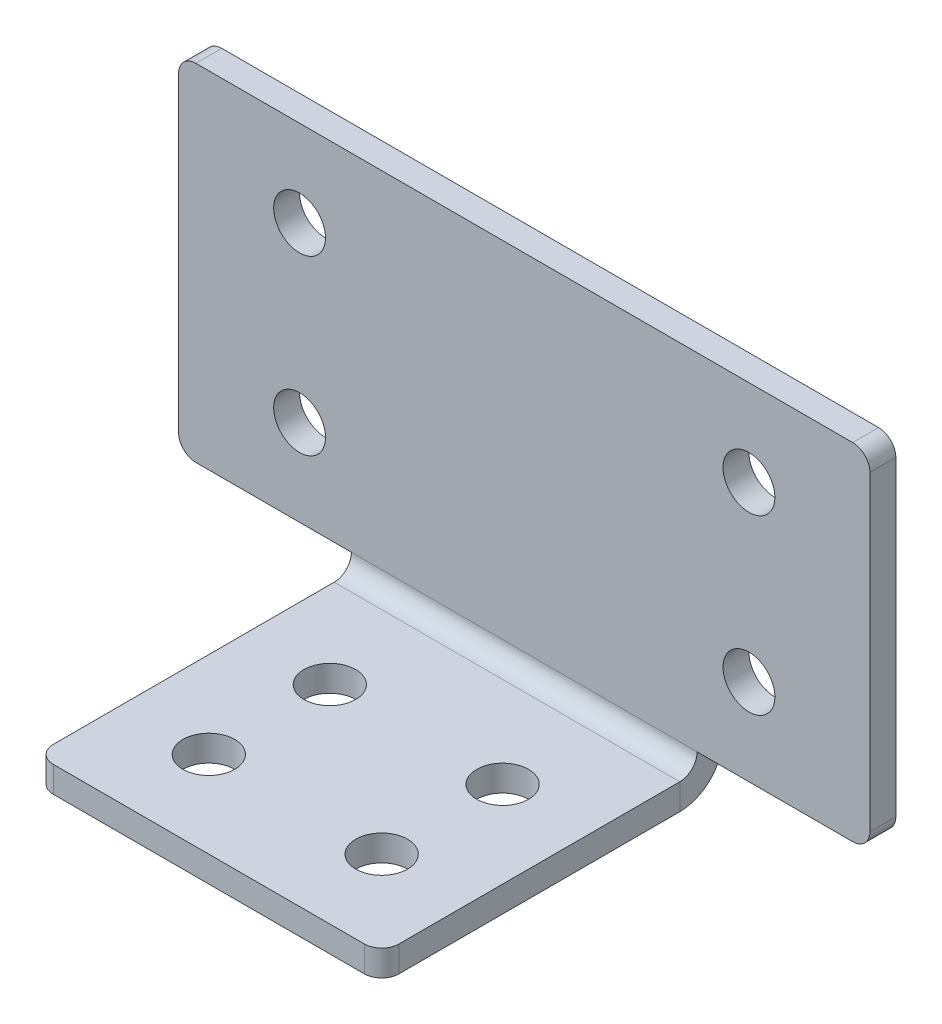
ISO-10303-21;
HEADER;
FILE_DESCRIPTION(('STEP AP214'),'2;1');
FILE_NAME('part.step','',(''),(''),'','','');
FILE_SCHEMA(('AUTOMOTIVE_DESIGN { 1 0 10303 214 1 1 1 1 }'));
ENDSEC;
DATA;
#1=APPLICATION_CONTEXT('core data for automotive mechanical design processes');
#2=APPLICATION_PROTOCOL_DEFINITION('international standard','automotive_design',2000,#1);
#3=PRODUCT_CONTEXT('',#1,'mechanical');
#4=PRODUCT('Part','Part','',(#3));
#5=PRODUCT_RELATED_PRODUCT_CATEGORY('part','',(#4));
#6=PRODUCT_DEFINITION_FORMATION('','',#4);
#7=PRODUCT_DEFINITION_CONTEXT('part definition',#1,'design');
#8=PRODUCT_DEFINITION('design','',#6,#7);
#9=PRODUCT_DEFINITION_SHAPE('','',#8);
#10=(LENGTH_UNIT() NAMED_UNIT(*) SI_UNIT(.MILLI.,.METRE.));
#11=(NAMED_UNIT(*) PLANE_ANGLE_UNIT() SI_UNIT($,.RADIAN.));
#12=(NAMED_UNIT(*) SI_UNIT($,.STERADIAN.) SOLID_ANGLE_UNIT());
#13=UNCERTAINTY_MEASURE_WITH_UNIT(LENGTH_MEASURE(1.E-05),#10,'distance_accuracy_value','');
#14=(GEOMETRIC_REPRESENTATION_CONTEXT(3) GLOBAL_UNCERTAINTY_ASSIGNED_CONTEXT((#13)) GLOBAL_UNIT_ASSIGNED_CONTEXT((#10,
#11,#12)) REPRESENTATION_CONTEXT('',''));
#15=CARTESIAN_POINT('',(0.,0.,0.));
#16=DIRECTION('',(0.,0.,1.));
#17=DIRECTION('',(1.,0.,0.));
#18=AXIS2_PLACEMENT_3D('',#15,#16,#17);
#19=CARTESIAN_POINT('',(-10.,7.50000000000007,18.2511064281089));
#20=DIRECTION('',(-1.,0.,0.));
#21=DIRECTION('',(0.,1.,0.));
#22=AXIS2_PLACEMENT_3D('',#19,#20,#21);
#23=PLANE('',#22);
#24=DIRECTION('',(0.,0.,1.));
#25=VECTOR('',#24,1.);
#26=CARTESIAN_POINT('',(-10.,7.50000000000007,18.2511064281089));
#27=LINE('',#26,#25);
#28=CARTESIAN_POINT('',(-10.,7.50000000000001,0.999999999999997));
#29=VERTEX_POINT('',#28);
#30=CARTESIAN_POINT('',(-10.,7.50000000000006,17.2511064281089));
#31=VERTEX_POINT('',#30);
#32=EDGE_CURVE('E184',#29,#31,#27,.T.);
#33=ORIENTED_EDGE('',*,*,#32,.T.);
#34=DIRECTION('',(0.,1.,0.));
#35=VECTOR('',#34,1.);
#36=CARTESIAN_POINT('',(-10.,7.50000000000006,17.2511064281089));
#37=LINE('',#36,#35);
#38=CARTESIAN_POINT('',(-10.,9.00000000000006,17.2511064281089));
#39=VERTEX_POINT('',#38);
#40=EDGE_CURVE('E247',#31,#39,#37,.T.);
#41=ORIENTED_EDGE('',*,*,#40,.T.);
#42=DIRECTION('',(0.,0.,1.));
#43=VECTOR('',#42,1.);
#44=CARTESIAN_POINT('',(-10.,9.00000000000007,18.2511064281089));
#45=LINE('',#44,#43);
#46=CARTESIAN_POINT('',(-10.,9.00000000000001,0.999999999999999));
#47=VERTEX_POINT('',#46);
#48=EDGE_CURVE('E194',#47,#39,#45,.T.);
#49=ORIENTED_EDGE('',*,*,#48,.F.);
#50=DIRECTION('',(0.,-1.,0.));
#51=VECTOR('',#50,1.);
#52=CARTESIAN_POINT('',(-10.,7.50000000000013,1.00000000000001));
#53=LINE('',#52,#51);
#54=EDGE_CURVE('E170',#47,#29,#53,.T.);
#55=ORIENTED_EDGE('',*,*,#54,.T.);
#56=EDGE_LOOP('',(#33,#41,#49,#55));
#57=FACE_BOUND('',#56,.T.);
#58=ADVANCED_FACE('F45',(#57),#23,.T.);
#59=CARTESIAN_POINT('',(10.,7.50000000000007,18.2511064281089));
#60=DIRECTION('',(1.,0.,0.));
#61=DIRECTION('',(0.,-1.,0.));
#62=AXIS2_PLACEMENT_3D('',#59,#60,#61);
#63=PLANE('',#62);
#64=DIRECTION('',(0.,0.,-1.));
#65=VECTOR('',#64,1.);
#66=CARTESIAN_POINT('',(10.,9.00000000000007,18.2511064281089));
#67=LINE('',#66,#65);
#68=CARTESIAN_POINT('',(10.,9.00000000000006,17.2511064281089));
#69=VERTEX_POINT('',#68);
#70=CARTESIAN_POINT('',(10.,9.00000000000001,0.999999999999999));
#71=VERTEX_POINT('',#70);
#72=EDGE_CURVE('E208',#69,#71,#67,.T.);
#73=ORIENTED_EDGE('',*,*,#72,.F.);
#74=DIRECTION('',(0.,1.,0.));
#75=VECTOR('',#74,1.);
#76=CARTESIAN_POINT('',(10.,7.50000000000006,17.2511064281089));
#77=LINE('',#76,#75);
#78=CARTESIAN_POINT('',(10.,7.50000000000006,17.2511064281089));
#79=VERTEX_POINT('',#78);
#80=EDGE_CURVE('E12',#69,#79,#77,.F.);
#81=ORIENTED_EDGE('',*,*,#80,.T.);
#82=DIRECTION('',(0.,0.,-1.));
#83=VECTOR('',#82,1.);
#84=CARTESIAN_POINT('',(10.,7.50000000000007,18.2511064281089));
#85=LINE('',#84,#83);
#86=CARTESIAN_POINT('',(10.,7.50000000000001,1.00000000000001));
#87=VERTEX_POINT('',#86);
#88=EDGE_CURVE('E190',#79,#87,#85,.T.);
#89=ORIENTED_EDGE('',*,*,#88,.T.);
#90=DIRECTION('',(0.,1.,0.));
#91=VECTOR('',#90,1.);
#92=CARTESIAN_POINT('',(10.,7.50000000000013,1.00000000000001));
#93=LINE('',#92,#91);
#94=EDGE_CURVE('E199',#87,#71,#93,.T.);
#95=ORIENTED_EDGE('',*,*,#94,.T.);
#96=EDGE_LOOP('',(#73,#81,#89,#95));
#97=FACE_BOUND('',#96,.T.);
#98=ADVANCED_FACE('F360',(#97),#63,.T.);
#99=CARTESIAN_POINT('',(0.,7.50000000000003,8.25110642810894));
#100=DIRECTION('',(0.,-1.,0.));
#101=DIRECTION('',(-1.,0.,0.));
#102=AXIS2_PLACEMENT_3D('',#99,#100,#101);
#103=PLANE('',#102);
#104=CARTESIAN_POINT('',(5.,7.50000000000005,13.2511064281089));
#105=DIRECTION('',(0.,-1.,0.));
#106=DIRECTION('',(0.,0.,-1.));
#107=AXIS2_PLACEMENT_3D('',#104,#105,#106);
#108=CIRCLE('',#107,1.5);
#109=CARTESIAN_POINT('',(5.,7.50000000000004,11.7511064281089));
#110=VERTEX_POINT('',#109);
#111=EDGE_CURVE('E457',#110,#110,#108,.T.);
#112=ORIENTED_EDGE('',*,*,#111,.F.);
#113=EDGE_LOOP('',(#112));
#114=FACE_BOUND('',#113,.T.);
#115=CARTESIAN_POINT('',(-5.,7.50000000000002,6.25110642810894));
#116=DIRECTION('',(0.,-1.,0.));
#117=DIRECTION('',(0.,0.,-1.));
#118=AXIS2_PLACEMENT_3D('',#115,#116,#117);
#119=CIRCLE('',#118,1.5);
#120=CARTESIAN_POINT('',(-5.,7.50000000000002,4.75110642810894));
#121=VERTEX_POINT('',#120);
#122=EDGE_CURVE('E461',#121,#121,#119,.T.);
#123=ORIENTED_EDGE('',*,*,#122,.F.);
#124=EDGE_LOOP('',(#123));
#125=FACE_BOUND('',#124,.T.);
#126=CARTESIAN_POINT('',(5.,7.50000000000002,6.25110642810894));
#127=DIRECTION('',(0.,-1.,0.));
#128=DIRECTION('',(0.,0.,-1.));
#129=AXIS2_PLACEMENT_3D('',#126,#127,#128);
#130=CIRCLE('',#129,1.5);
#131=CARTESIAN_POINT('',(5.,7.50000000000002,4.75110642810894));
#132=VERTEX_POINT('',#131);
#133=EDGE_CURVE('E465',#132,#132,#130,.T.);
#134=ORIENTED_EDGE('',*,*,#133,.F.);
#135=EDGE_LOOP('',(#134));
#136=FACE_BOUND('',#135,.T.);
#137=CARTESIAN_POINT('',(-5.,7.50000000000005,13.2511064281089));
#138=DIRECTION('',(0.,-1.,0.));
#139=DIRECTION('',(0.,0.,-1.));
#140=AXIS2_PLACEMENT_3D('',#137,#138,#139);
#141=CIRCLE('',#140,1.5);
#142=CARTESIAN_POINT('',(-5.,7.50000000000004,11.7511064281089));
#143=VERTEX_POINT('',#142);
#144=EDGE_CURVE('E278',#143,#143,#141,.T.);
#145=ORIENTED_EDGE('',*,*,#144,.F.);
#146=EDGE_LOOP('',(#145));
#147=FACE_BOUND('',#146,.T.);
#148=DIRECTION('',(1.,0.,0.));
#149=VECTOR('',#148,1.);
#150=CARTESIAN_POINT('',(-10.,7.50000000000007,18.2511064281089));
#151=LINE('',#150,#149);
#152=CARTESIAN_POINT('',(-9.,7.50000000000007,18.2511064281089));
#153=VERTEX_POINT('',#152);
#154=CARTESIAN_POINT('',(9.,7.50000000000007,18.2511064281089));
#155=VERTEX_POINT('',#154);
#156=EDGE_CURVE('E171',#153,#155,#151,.T.);
#157=ORIENTED_EDGE('',*,*,#156,.F.);
#158=CARTESIAN_POINT('',(-9.,7.50000000000006,17.2511064281089));
#159=DIRECTION('',(0.,-1.,0.));
#160=DIRECTION('',(0.,0.,-1.));
#161=AXIS2_PLACEMENT_3D('',#158,#159,#160);
#162=CIRCLE('',#161,1.);
#163=EDGE_CURVE('E54',#153,#31,#162,.T.);
#164=ORIENTED_EDGE('',*,*,#163,.T.);
#165=ORIENTED_EDGE('',*,*,#32,.F.);
#166=DIRECTION('',(1.,0.,0.));
#167=VECTOR('',#166,1.);
#168=CARTESIAN_POINT('',(0.,7.50000000000001,1.00000000000001));
#169=LINE('',#168,#167);
#170=EDGE_CURVE('E161',#29,#87,#169,.T.);
#171=ORIENTED_EDGE('',*,*,#170,.T.);
#172=ORIENTED_EDGE('',*,*,#88,.F.);
#173=CARTESIAN_POINT('',(9.,7.50000000000006,17.2511064281089));
#174=DIRECTION('',(0.,-1.,0.));
#175=DIRECTION('',(0.,0.,-1.));
#176=AXIS2_PLACEMENT_3D('',#173,#174,#175);
#177=CIRCLE('',#176,1.);
#178=EDGE_CURVE('E67',#79,#155,#177,.T.);
#179=ORIENTED_EDGE('',*,*,#178,.T.);
#180=EDGE_LOOP('',(#157,#164,#165,#171,#172,#179));
#181=FACE_BOUND('',#180,.T.);
#182=ADVANCED_FACE('F185',(#114,#125,#136,#147,#181),#103,.T.);
#183=CARTESIAN_POINT('',(-10.,7.50000000000007,18.2511064281089));
#184=DIRECTION('',(0.,0.,1.));
#185=DIRECTION('',(0.,-1.,0.));
#186=AXIS2_PLACEMENT_3D('',#183,#184,#185);
#187=PLANE('',#186);
#188=DIRECTION('',(1.,0.,0.));
#189=VECTOR('',#188,1.);
#190=CARTESIAN_POINT('',(-10.,9.00000000000007,18.2511064281089));
#191=LINE('',#190,#189);
#192=CARTESIAN_POINT('',(-9.,9.00000000000007,18.2511064281089));
#193=VERTEX_POINT('',#192);
#194=CARTESIAN_POINT('',(9.,9.00000000000007,18.2511064281089));
#195=VERTEX_POINT('',#194);
#196=EDGE_CURVE('E207',#193,#195,#191,.T.);
#197=ORIENTED_EDGE('',*,*,#196,.F.);
#198=DIRECTION('',(0.,1.,0.));
#199=VECTOR('',#198,1.);
#200=CARTESIAN_POINT('',(-9.,7.50000000000007,18.2511064281089));
#201=LINE('',#200,#199);
#202=EDGE_CURVE('E256',#193,#153,#201,.F.);
#203=ORIENTED_EDGE('',*,*,#202,.T.);
#204=ORIENTED_EDGE('',*,*,#156,.T.);
#205=DIRECTION('',(0.,1.,0.));
#206=VECTOR('',#205,1.);
#207=CARTESIAN_POINT('',(9.,7.50000000000007,18.2511064281089));
#208=LINE('',#207,#206);
#209=EDGE_CURVE('E253',#155,#195,#208,.T.);
#210=ORIENTED_EDGE('',*,*,#209,.T.);
#211=EDGE_LOOP('',(#197,#203,#204,#210));
#212=FACE_BOUND('',#211,.T.);
#213=ADVANCED_FACE('F348',(#212),#187,.T.);
#214=CARTESIAN_POINT('',(0.,9.00000000000003,8.25110642810894));
#215=DIRECTION('',(0.,-1.,0.));
#216=DIRECTION('',(-1.,0.,0.));
#217=AXIS2_PLACEMENT_3D('',#214,#215,#216);
#218=PLANE('',#217);
#219=CARTESIAN_POINT('',(5.,9.00000000000005,13.2511064281089));
#220=DIRECTION('',(0.,-1.,0.));
#221=DIRECTION('',(0.,0.,-1.));
#222=AXIS2_PLACEMENT_3D('',#219,#220,#221);
#223=CIRCLE('',#222,1.5);
#224=CARTESIAN_POINT('',(5.,9.00000000000004,11.7511064281089));
#225=VERTEX_POINT('',#224);
#226=EDGE_CURVE('E49',#225,#225,#223,.T.);
#227=ORIENTED_EDGE('',*,*,#226,.T.);
#228=EDGE_LOOP('',(#227));
#229=FACE_BOUND('',#228,.T.);
#230=CARTESIAN_POINT('',(-5.,9.00000000000002,6.25110642810894));
#231=DIRECTION('',(0.,-1.,0.));
#232=DIRECTION('',(0.,0.,-1.));
#233=AXIS2_PLACEMENT_3D('',#230,#231,#232);
#234=CIRCLE('',#233,1.5);
#235=CARTESIAN_POINT('',(-5.,9.00000000000002,4.75110642810894));
#236=VERTEX_POINT('',#235);
#237=EDGE_CURVE('E280',#236,#236,#234,.T.);
#238=ORIENTED_EDGE('',*,*,#237,.T.);
#239=EDGE_LOOP('',(#238));
#240=FACE_BOUND('',#239,.T.);
#241=CARTESIAN_POINT('',(5.,9.00000000000002,6.25110642810894));
#242=DIRECTION('',(0.,-1.,0.));
#243=DIRECTION('',(0.,0.,-1.));
#244=AXIS2_PLACEMENT_3D('',#241,#242,#243);
#245=CIRCLE('',#244,1.5);
#246=CARTESIAN_POINT('',(5.,9.00000000000002,4.75110642810894));
#247=VERTEX_POINT('',#246);
#248=EDGE_CURVE('E277',#247,#247,#245,.T.);
#249=ORIENTED_EDGE('',*,*,#248,.T.);
#250=EDGE_LOOP('',(#249));
#251=FACE_BOUND('',#250,.T.);
#252=CARTESIAN_POINT('',(-5.,9.00000000000005,13.2511064281089));
#253=DIRECTION('',(0.,-1.,0.));
#254=DIRECTION('',(0.,0.,-1.));
#255=AXIS2_PLACEMENT_3D('',#252,#253,#254);
#256=CIRCLE('',#255,1.5);
#257=CARTESIAN_POINT('',(-5.,9.00000000000004,11.7511064281089));
#258=VERTEX_POINT('',#257);
#259=EDGE_CURVE('E274',#258,#258,#256,.T.);
#260=ORIENTED_EDGE('',*,*,#259,.T.);
#261=EDGE_LOOP('',(#260));
#262=FACE_BOUND('',#261,.T.);
#263=ORIENTED_EDGE('',*,*,#48,.T.);
#264=CARTESIAN_POINT('',(-9.,9.00000000000006,17.2511064281089));
#265=DIRECTION('',(0.,-1.,0.));
#266=DIRECTION('',(0.,0.,-1.));
#267=AXIS2_PLACEMENT_3D('',#264,#265,#266);
#268=CIRCLE('',#267,1.);
#269=EDGE_CURVE('E251',#39,#193,#268,.F.);
#270=ORIENTED_EDGE('',*,*,#269,.T.);
#271=ORIENTED_EDGE('',*,*,#196,.T.);
#272=CARTESIAN_POINT('',(9.,9.00000000000006,17.2511064281089));
#273=DIRECTION('',(0.,-1.,0.));
#274=DIRECTION('',(0.,0.,-1.));
#275=AXIS2_PLACEMENT_3D('',#272,#273,#274);
#276=CIRCLE('',#275,1.);
#277=EDGE_CURVE('E249',#195,#69,#276,.F.);
#278=ORIENTED_EDGE('',*,*,#277,.T.);
#279=ORIENTED_EDGE('',*,*,#72,.T.);
#280=DIRECTION('',(1.,0.,0.));
#281=VECTOR('',#280,1.);
#282=CARTESIAN_POINT('',(0.,9.00000000000001,1.00000000000001));
#283=LINE('',#282,#281);
#284=EDGE_CURVE('E196',#47,#71,#283,.T.);
#285=ORIENTED_EDGE('',*,*,#284,.F.);
#286=EDGE_LOOP('',(#263,#270,#271,#278,#279,#285));
#287=FACE_BOUND('',#286,.T.);
#288=ADVANCED_FACE('F345',(#229,#240,#251,#262,#287),#218,.F.);
#289=CARTESIAN_POINT('',(20.,30.,-1.5));
#290=DIRECTION('',(1.,0.,0.));
#291=DIRECTION('',(0.,1.,0.));
#292=AXIS2_PLACEMENT_3D('',#289,#290,#291);
#293=PLANE('',#292);
#294=DIRECTION('',(0.,1.,0.));
#295=VECTOR('',#294,1.);
#296=CARTESIAN_POINT('',(20.,30.,-1.5));
#297=LINE('',#296,#295);
#298=CARTESIAN_POINT('',(20.,11.,-1.5));
#299=VERTEX_POINT('',#298);
#300=CARTESIAN_POINT('',(20.,29.,-1.5));
#301=VERTEX_POINT('',#300);
#302=EDGE_CURVE('E336',#299,#301,#297,.T.);
#303=ORIENTED_EDGE('',*,*,#302,.T.);
#304=DIRECTION('',(0.,0.,1.));
#305=VECTOR('',#304,1.);
#306=CARTESIAN_POINT('',(20.,29.,-1.5));
#307=LINE('',#306,#305);
#308=CARTESIAN_POINT('',(20.,29.,0.));
#309=VERTEX_POINT('',#308);
#310=EDGE_CURVE('E239',#301,#309,#307,.T.);
#311=ORIENTED_EDGE('',*,*,#310,.T.);
#312=DIRECTION('',(0.,1.,0.));
#313=VECTOR('',#312,1.);
#314=CARTESIAN_POINT('',(20.,30.,0.));
#315=LINE('',#314,#313);
#316=CARTESIAN_POINT('',(20.,11.,0.));
#317=VERTEX_POINT('',#316);
#318=EDGE_CURVE('E316',#317,#309,#315,.T.);
#319=ORIENTED_EDGE('',*,*,#318,.F.);
#320=DIRECTION('',(0.,0.,1.));
#321=VECTOR('',#320,1.);
#322=CARTESIAN_POINT('',(20.,11.,-1.5));
#323=LINE('',#322,#321);
#324=EDGE_CURVE('E237',#317,#299,#323,.F.);
#325=ORIENTED_EDGE('',*,*,#324,.T.);
#326=EDGE_LOOP('',(#303,#311,#319,#325));
#327=FACE_BOUND('',#326,.T.);
#328=ADVANCED_FACE('F382',(#327),#293,.T.);
#329=CARTESIAN_POINT('',(-20.,30.,-1.5));
#330=DIRECTION('',(0.,1.,0.));
#331=DIRECTION('',(0.,0.,1.));
#332=AXIS2_PLACEMENT_3D('',#329,#330,#331);
#333=PLANE('',#332);
#334=DIRECTION('',(-1.,0.,0.));
#335=VECTOR('',#334,1.);
#336=CARTESIAN_POINT('',(-20.,30.,-1.5));
#337=LINE('',#336,#335);
#338=CARTESIAN_POINT('',(19.,30.,-1.5));
#339=VERTEX_POINT('',#338);
#340=CARTESIAN_POINT('',(-19.,30.,-1.5));
#341=VERTEX_POINT('',#340);
#342=EDGE_CURVE('E333',#339,#341,#337,.T.);
#343=ORIENTED_EDGE('',*,*,#342,.T.);
#344=DIRECTION('',(0.,0.,1.));
#345=VECTOR('',#344,1.);
#346=CARTESIAN_POINT('',(-19.,30.,-1.5));
#347=LINE('',#346,#345);
#348=CARTESIAN_POINT('',(-19.,30.,0.));
#349=VERTEX_POINT('',#348);
#350=EDGE_CURVE('E213',#341,#349,#347,.T.);
#351=ORIENTED_EDGE('',*,*,#350,.T.);
#352=DIRECTION('',(-1.,0.,0.));
#353=VECTOR('',#352,1.);
#354=CARTESIAN_POINT('',(-20.,30.,0.));
#355=LINE('',#354,#353);
#356=CARTESIAN_POINT('',(19.,30.,0.));
#357=VERTEX_POINT('',#356);
#358=EDGE_CURVE('E313',#357,#349,#355,.T.);
#359=ORIENTED_EDGE('',*,*,#358,.F.);
#360=DIRECTION('',(0.,0.,1.));
#361=VECTOR('',#360,1.);
#362=CARTESIAN_POINT('',(19.,30.,-1.5));
#363=LINE('',#362,#361);
#364=EDGE_CURVE('E205',#357,#339,#363,.F.);
#365=ORIENTED_EDGE('',*,*,#364,.T.);
#366=EDGE_LOOP('',(#343,#351,#359,#365));
#367=FACE_BOUND('',#366,.T.);
#368=ADVANCED_FACE('F416',(#367),#333,.T.);
#369=CARTESIAN_POINT('',(-20.,30.,-1.5));
#370=DIRECTION('',(-1.,0.,0.));
#371=DIRECTION('',(0.,-1.,0.));
#372=AXIS2_PLACEMENT_3D('',#369,#370,#371);
#373=PLANE('',#372);
#374=DIRECTION('',(0.,-1.,0.));
#375=VECTOR('',#374,1.);
#376=CARTESIAN_POINT('',(-20.,30.,0.));
#377=LINE('',#376,#375);
#378=CARTESIAN_POINT('',(-20.,29.,0.));
#379=VERTEX_POINT('',#378);
#380=CARTESIAN_POINT('',(-20.,11.,0.));
#381=VERTEX_POINT('',#380);
#382=EDGE_CURVE('E310',#379,#381,#377,.T.);
#383=ORIENTED_EDGE('',*,*,#382,.F.);
#384=DIRECTION('',(0.,0.,1.));
#385=VECTOR('',#384,1.);
#386=CARTESIAN_POINT('',(-20.,29.,-1.5));
#387=LINE('',#386,#385);
#388=CARTESIAN_POINT('',(-20.,29.,-1.5));
#389=VERTEX_POINT('',#388);
#390=EDGE_CURVE('E227',#379,#389,#387,.F.);
#391=ORIENTED_EDGE('',*,*,#390,.T.);
#392=DIRECTION('',(0.,-1.,0.));
#393=VECTOR('',#392,1.);
#394=CARTESIAN_POINT('',(-20.,30.,-1.5));
#395=LINE('',#394,#393);
#396=CARTESIAN_POINT('',(-20.,11.,-1.5));
#397=VERTEX_POINT('',#396);
#398=EDGE_CURVE('E330',#389,#397,#395,.T.);
#399=ORIENTED_EDGE('',*,*,#398,.T.);
#400=DIRECTION('',(0.,0.,1.));
#401=VECTOR('',#400,1.);
#402=CARTESIAN_POINT('',(-20.,11.,-1.5));
#403=LINE('',#402,#401);
#404=EDGE_CURVE('E224',#397,#381,#403,.T.);
#405=ORIENTED_EDGE('',*,*,#404,.T.);
#406=EDGE_LOOP('',(#383,#391,#399,#405));
#407=FACE_BOUND('',#406,.T.);
#408=ADVANCED_FACE('F410',(#407),#373,.T.);
#409=CARTESIAN_POINT('',(0.,0.,-1.5));
#410=DIRECTION('',(0.,0.,-1.));
#411=DIRECTION('',(-1.,0.,0.));
#412=AXIS2_PLACEMENT_3D('',#409,#410,#411);
#413=PLANE('',#412);
#414=CARTESIAN_POINT('',(-13.,25.,-1.5));
#415=DIRECTION('',(0.,0.,-1.));
#416=DIRECTION('',(-1.,0.,0.));
#417=AXIS2_PLACEMENT_3D('',#414,#415,#416);
#418=CIRCLE('',#417,1.5);
#419=CARTESIAN_POINT('',(-14.5,25.,-1.5));
#420=VERTEX_POINT('',#419);
#421=EDGE_CURVE('E294',#420,#420,#418,.T.);
#422=ORIENTED_EDGE('',*,*,#421,.F.);
#423=EDGE_LOOP('',(#422));
#424=FACE_BOUND('',#423,.T.);
#425=CARTESIAN_POINT('',(13.,15.,-1.5));
#426=DIRECTION('',(0.,0.,-1.));
#427=DIRECTION('',(-1.,0.,0.));
#428=AXIS2_PLACEMENT_3D('',#425,#426,#427);
#429=CIRCLE('',#428,1.5);
#430=CARTESIAN_POINT('',(11.5,15.,-1.5));
#431=VERTEX_POINT('',#430);
#432=EDGE_CURVE('E289',#431,#431,#429,.T.);
#433=ORIENTED_EDGE('',*,*,#432,.F.);
#434=EDGE_LOOP('',(#433));
#435=FACE_BOUND('',#434,.T.);
#436=CARTESIAN_POINT('',(-13.,15.,-1.5));
#437=DIRECTION('',(0.,0.,-1.));
#438=DIRECTION('',(-1.,0.,0.));
#439=AXIS2_PLACEMENT_3D('',#436,#437,#438);
#440=CIRCLE('',#439,1.5);
#441=CARTESIAN_POINT('',(-14.5,15.,-1.5));
#442=VERTEX_POINT('',#441);
#443=EDGE_CURVE('E285',#442,#442,#440,.T.);
#444=ORIENTED_EDGE('',*,*,#443,.F.);
#445=EDGE_LOOP('',(#444));
#446=FACE_BOUND('',#445,.T.);
#447=CARTESIAN_POINT('',(13.,25.,-1.5));
#448=DIRECTION('',(0.,0.,-1.));
#449=DIRECTION('',(-1.,0.,0.));
#450=AXIS2_PLACEMENT_3D('',#447,#448,#449);
#451=CIRCLE('',#450,1.5);
#452=CARTESIAN_POINT('',(11.5,25.,-1.5));
#453=VERTEX_POINT('',#452);
#454=EDGE_CURVE('E264',#453,#453,#451,.T.);
#455=ORIENTED_EDGE('',*,*,#454,.F.);
#456=EDGE_LOOP('',(#455));
#457=FACE_BOUND('',#456,.T.);
#458=ORIENTED_EDGE('',*,*,#398,.F.);
#459=CARTESIAN_POINT('',(-19.,29.,-1.5));
#460=DIRECTION('',(0.,0.,-1.));
#461=DIRECTION('',(-1.,0.,0.));
#462=AXIS2_PLACEMENT_3D('',#459,#460,#461);
#463=CIRCLE('',#462,1.);
#464=EDGE_CURVE('E235',#389,#341,#463,.T.);
#465=ORIENTED_EDGE('',*,*,#464,.T.);
#466=ORIENTED_EDGE('',*,*,#342,.F.);
#467=CARTESIAN_POINT('',(19.,29.,-1.5));
#468=DIRECTION('',(0.,0.,-1.));
#469=DIRECTION('',(-1.,0.,0.));
#470=AXIS2_PLACEMENT_3D('',#467,#468,#469);
#471=CIRCLE('',#470,1.);
#472=EDGE_CURVE('E233',#339,#301,#471,.T.);
#473=ORIENTED_EDGE('',*,*,#472,.T.);
#474=ORIENTED_EDGE('',*,*,#302,.F.);
#475=CARTESIAN_POINT('',(19.,11.,-1.5));
#476=DIRECTION('',(0.,0.,-1.));
#477=DIRECTION('',(-1.,0.,0.));
#478=AXIS2_PLACEMENT_3D('',#475,#476,#477);
#479=CIRCLE('',#478,1.);
#480=CARTESIAN_POINT('',(19.,10.,-1.5));
#481=VERTEX_POINT('',#480);
#482=EDGE_CURVE('E231',#299,#481,#479,.T.);
#483=ORIENTED_EDGE('',*,*,#482,.T.);
#484=DIRECTION('',(1.,0.,0.));
#485=VECTOR('',#484,1.);
#486=CARTESIAN_POINT('',(10.,10.,-1.5));
#487=LINE('',#486,#485);
#488=CARTESIAN_POINT('',(10.,10.,-1.5));
#489=VERTEX_POINT('',#488);
#490=EDGE_CURVE('E210',#489,#481,#487,.T.);
#491=ORIENTED_EDGE('',*,*,#490,.F.);
#492=DIRECTION('',(1.,0.,0.));
#493=VECTOR('',#492,1.);
#494=CARTESIAN_POINT('',(0.,10.,-1.5));
#495=LINE('',#494,#493);
#496=CARTESIAN_POINT('',(-10.,10.,-1.5));
#497=VERTEX_POINT('',#496);
#498=EDGE_CURVE('E304',#497,#489,#495,.T.);
#499=ORIENTED_EDGE('',*,*,#498,.F.);
#500=DIRECTION('',(1.,0.,0.));
#501=VECTOR('',#500,1.);
#502=CARTESIAN_POINT('',(-20.,10.,-1.5));
#503=LINE('',#502,#501);
#504=CARTESIAN_POINT('',(-19.,10.,-1.5));
#505=VERTEX_POINT('',#504);
#506=EDGE_CURVE('E328',#505,#497,#503,.T.);
#507=ORIENTED_EDGE('',*,*,#506,.F.);
#508=CARTESIAN_POINT('',(-19.,11.,-1.5));
#509=DIRECTION('',(0.,0.,-1.));
#510=DIRECTION('',(-1.,0.,0.));
#511=AXIS2_PLACEMENT_3D('',#508,#509,#510);
#512=CIRCLE('',#511,1.);
#513=EDGE_CURVE('E229',#505,#397,#512,.T.);
#514=ORIENTED_EDGE('',*,*,#513,.T.);
#515=EDGE_LOOP('',(#458,#465,#466,#473,#474,#483,#491,#499,#507,#514));
#516=FACE_BOUND('',#515,.T.);
#517=ADVANCED_FACE('F406',(#424,#435,#446,#457,#516),#413,.T.);
#518=CARTESIAN_POINT('',(-20.,10.,-1.5));
#519=DIRECTION('',(0.,-1.,0.));
#520=DIRECTION('',(1.,0.,0.));
#521=AXIS2_PLACEMENT_3D('',#518,#519,#520);
#522=PLANE('',#521);
#523=DIRECTION('',(1.,0.,0.));
#524=VECTOR('',#523,1.);
#525=CARTESIAN_POINT('',(-20.,10.,0.));
#526=LINE('',#525,#524);
#527=CARTESIAN_POINT('',(-19.,10.,0.));
#528=VERTEX_POINT('',#527);
#529=CARTESIAN_POINT('',(-10.,10.,0.));
#530=VERTEX_POINT('',#529);
#531=EDGE_CURVE('E325',#528,#530,#526,.T.);
#532=ORIENTED_EDGE('',*,*,#531,.F.);
#533=DIRECTION('',(0.,0.,1.));
#534=VECTOR('',#533,1.);
#535=CARTESIAN_POINT('',(-19.,10.,-1.5));
#536=LINE('',#535,#534);
#537=EDGE_CURVE('E245',#528,#505,#536,.F.);
#538=ORIENTED_EDGE('',*,*,#537,.T.);
#539=ORIENTED_EDGE('',*,*,#506,.T.);
#540=DIRECTION('',(0.,0.,1.));
#541=VECTOR('',#540,1.);
#542=CARTESIAN_POINT('',(-10.,10.,-1.5));
#543=LINE('',#542,#541);
#544=EDGE_CURVE('E180',#497,#530,#543,.T.);
#545=ORIENTED_EDGE('',*,*,#544,.T.);
#546=EDGE_LOOP('',(#532,#538,#539,#545));
#547=FACE_BOUND('',#546,.T.);
#548=ADVANCED_FACE('F433',(#547),#522,.T.);
#549=CARTESIAN_POINT('',(0.,0.,0.));
#550=DIRECTION('',(0.,0.,-1.));
#551=DIRECTION('',(-1.,0.,0.));
#552=AXIS2_PLACEMENT_3D('',#549,#550,#551);
#553=PLANE('',#552);
#554=CARTESIAN_POINT('',(-13.,25.,0.));
#555=DIRECTION('',(0.,0.,-1.));
#556=DIRECTION('',(-1.,0.,0.));
#557=AXIS2_PLACEMENT_3D('',#554,#555,#556);
#558=CIRCLE('',#557,1.5);
#559=CARTESIAN_POINT('',(-14.5,25.,0.));
#560=VERTEX_POINT('',#559);
#561=EDGE_CURVE('E270',#560,#560,#558,.T.);
#562=ORIENTED_EDGE('',*,*,#561,.T.);
#563=EDGE_LOOP('',(#562));
#564=FACE_BOUND('',#563,.T.);
#565=CARTESIAN_POINT('',(13.,15.,0.));
#566=DIRECTION('',(0.,0.,-1.));
#567=DIRECTION('',(-1.,0.,0.));
#568=AXIS2_PLACEMENT_3D('',#565,#566,#567);
#569=CIRCLE('',#568,1.5);
#570=CARTESIAN_POINT('',(11.5,15.,0.));
#571=VERTEX_POINT('',#570);
#572=EDGE_CURVE('E267',#571,#571,#569,.T.);
#573=ORIENTED_EDGE('',*,*,#572,.T.);
#574=EDGE_LOOP('',(#573));
#575=FACE_BOUND('',#574,.T.);
#576=CARTESIAN_POINT('',(-13.,15.,0.));
#577=DIRECTION('',(0.,0.,-1.));
#578=DIRECTION('',(-1.,0.,0.));
#579=AXIS2_PLACEMENT_3D('',#576,#577,#578);
#580=CIRCLE('',#579,1.5);
#581=CARTESIAN_POINT('',(-14.5,15.,0.));
#582=VERTEX_POINT('',#581);
#583=EDGE_CURVE('E263',#582,#582,#580,.T.);
#584=ORIENTED_EDGE('',*,*,#583,.T.);
#585=EDGE_LOOP('',(#584));
#586=FACE_BOUND('',#585,.T.);
#587=CARTESIAN_POINT('',(13.,25.,0.));
#588=DIRECTION('',(0.,0.,-1.));
#589=DIRECTION('',(-1.,0.,0.));
#590=AXIS2_PLACEMENT_3D('',#587,#588,#589);
#591=CIRCLE('',#590,1.5);
#592=CARTESIAN_POINT('',(11.5,25.,0.));
#593=VERTEX_POINT('',#592);
#594=EDGE_CURVE('E260',#593,#593,#591,.T.);
#595=ORIENTED_EDGE('',*,*,#594,.T.);
#596=EDGE_LOOP('',(#595));
#597=FACE_BOUND('',#596,.T.);
#598=ORIENTED_EDGE('',*,*,#358,.T.);
#599=CARTESIAN_POINT('',(-19.,29.,0.));
#600=DIRECTION('',(0.,0.,-1.));
#601=DIRECTION('',(-1.,0.,0.));
#602=AXIS2_PLACEMENT_3D('',#599,#600,#601);
#603=CIRCLE('',#602,1.);
#604=EDGE_CURVE('E222',#349,#379,#603,.F.);
#605=ORIENTED_EDGE('',*,*,#604,.T.);
#606=ORIENTED_EDGE('',*,*,#382,.T.);
#607=CARTESIAN_POINT('',(-19.,11.,0.));
#608=DIRECTION('',(0.,0.,-1.));
#609=DIRECTION('',(-1.,0.,0.));
#610=AXIS2_PLACEMENT_3D('',#607,#608,#609);
#611=CIRCLE('',#610,1.);
#612=EDGE_CURVE('E216',#381,#528,#611,.F.);
#613=ORIENTED_EDGE('',*,*,#612,.T.);
#614=ORIENTED_EDGE('',*,*,#531,.T.);
#615=DIRECTION('',(1.,0.,0.));
#616=VECTOR('',#615,1.);
#617=CARTESIAN_POINT('',(0.,10.,0.));
#618=LINE('',#617,#616);
#619=CARTESIAN_POINT('',(10.,10.,0.));
#620=VERTEX_POINT('',#619);
#621=EDGE_CURVE('E322',#530,#620,#618,.T.);
#622=ORIENTED_EDGE('',*,*,#621,.T.);
#623=DIRECTION('',(1.,0.,0.));
#624=VECTOR('',#623,1.);
#625=CARTESIAN_POINT('',(10.,10.,0.));
#626=LINE('',#625,#624);
#627=CARTESIAN_POINT('',(19.,10.,0.));
#628=VERTEX_POINT('',#627);
#629=EDGE_CURVE('E319',#620,#628,#626,.T.);
#630=ORIENTED_EDGE('',*,*,#629,.T.);
#631=CARTESIAN_POINT('',(19.,11.,0.));
#632=DIRECTION('',(0.,0.,-1.));
#633=DIRECTION('',(-1.,0.,0.));
#634=AXIS2_PLACEMENT_3D('',#631,#632,#633);
#635=CIRCLE('',#634,1.);
#636=EDGE_CURVE('E218',#628,#317,#635,.F.);
#637=ORIENTED_EDGE('',*,*,#636,.T.);
#638=ORIENTED_EDGE('',*,*,#318,.T.);
#639=CARTESIAN_POINT('',(19.,29.,0.));
#640=DIRECTION('',(0.,0.,-1.));
#641=DIRECTION('',(-1.,0.,0.));
#642=AXIS2_PLACEMENT_3D('',#639,#640,#641);
#643=CIRCLE('',#642,1.);
#644=EDGE_CURVE('E220',#309,#357,#643,.F.);
#645=ORIENTED_EDGE('',*,*,#644,.T.);
#646=EDGE_LOOP('',(#598,#605,#606,#613,#614,#622,#630,#637,#638,#645));
#647=FACE_BOUND('',#646,.T.);
#648=ADVANCED_FACE('F430',(#564,#575,#586,#597,#647),#553,.F.);
#649=CARTESIAN_POINT('',(10.,10.,-1.5));
#650=DIRECTION('',(0.,-1.,0.));
#651=DIRECTION('',(1.,0.,0.));
#652=AXIS2_PLACEMENT_3D('',#649,#650,#651);
#653=PLANE('',#652);
#654=ORIENTED_EDGE('',*,*,#490,.T.);
#655=DIRECTION('',(0.,0.,1.));
#656=VECTOR('',#655,1.);
#657=CARTESIAN_POINT('',(19.,10.,-1.5));
#658=LINE('',#657,#656);
#659=EDGE_CURVE('E242',#481,#628,#658,.T.);
#660=ORIENTED_EDGE('',*,*,#659,.T.);
#661=ORIENTED_EDGE('',*,*,#629,.F.);
#662=DIRECTION('',(0.,0.,1.));
#663=VECTOR('',#662,1.);
#664=CARTESIAN_POINT('',(10.,10.,-1.5));
#665=LINE('',#664,#663);
#666=EDGE_CURVE('E339',#489,#620,#665,.T.);
#667=ORIENTED_EDGE('',*,*,#666,.F.);
#668=EDGE_LOOP('',(#654,#660,#661,#667));
#669=FACE_BOUND('',#668,.T.);
#670=ADVANCED_FACE('F428',(#669),#653,.T.);
#671=CARTESIAN_POINT('',(-10.,10.,1.));
#672=DIRECTION('',(-1.,0.,0.));
#673=DIRECTION('',(0.,0.,1.));
#674=AXIS2_PLACEMENT_3D('',#671,#672,#673);
#675=PLANE('',#674);
#676=ORIENTED_EDGE('',*,*,#54,.F.);
#677=CARTESIAN_POINT('',(-10.,10.,1.));
#678=DIRECTION('',(-1.,0.,0.));
#679=DIRECTION('',(0.,0.,1.));
#680=AXIS2_PLACEMENT_3D('',#677,#678,#679);
#681=CIRCLE('',#680,1.);
#682=EDGE_CURVE('E273',#47,#530,#681,.F.);
#683=ORIENTED_EDGE('',*,*,#682,.T.);
#684=ORIENTED_EDGE('',*,*,#544,.F.);
#685=CARTESIAN_POINT('',(-10.,10.,1.));
#686=DIRECTION('',(1.,0.,0.));
#687=DIRECTION('',(0.,0.,1.));
#688=AXIS2_PLACEMENT_3D('',#685,#686,#687);
#689=CIRCLE('',#688,2.5);
#690=EDGE_CURVE('E164',#29,#497,#689,.T.);
#691=ORIENTED_EDGE('',*,*,#690,.F.);
#692=EDGE_LOOP('',(#676,#683,#684,#691));
#693=FACE_BOUND('',#692,.T.);
#694=ADVANCED_FACE('F175',(#693),#675,.T.);
#695=CARTESIAN_POINT('',(10.,10.,1.));
#696=DIRECTION('',(1.,0.,0.));
#697=DIRECTION('',(0.,0.,-1.));
#698=AXIS2_PLACEMENT_3D('',#695,#696,#697);
#699=PLANE('',#698);
#700=CARTESIAN_POINT('',(10.,10.,1.));
#701=DIRECTION('',(-1.,0.,0.));
#702=DIRECTION('',(0.,0.,1.));
#703=AXIS2_PLACEMENT_3D('',#700,#701,#702);
#704=CIRCLE('',#703,1.);
#705=EDGE_CURVE('E181',#620,#71,#704,.T.);
#706=ORIENTED_EDGE('',*,*,#705,.T.);
#707=ORIENTED_EDGE('',*,*,#94,.F.);
#708=CARTESIAN_POINT('',(10.,10.,1.));
#709=DIRECTION('',(-1.,0.,0.));
#710=DIRECTION('',(0.,0.,-1.));
#711=AXIS2_PLACEMENT_3D('',#708,#709,#710);
#712=CIRCLE('',#711,2.5);
#713=EDGE_CURVE('E167',#489,#87,#712,.T.);
#714=ORIENTED_EDGE('',*,*,#713,.F.);
#715=ORIENTED_EDGE('',*,*,#666,.T.);
#716=EDGE_LOOP('',(#706,#707,#714,#715));
#717=FACE_BOUND('',#716,.T.);
#718=ADVANCED_FACE('F358',(#717),#699,.T.);
#719=CARTESIAN_POINT('',(20.2436759475542,10.,1.));
#720=DIRECTION('',(-1.,0.,0.));
#721=DIRECTION('',(0.,0.,1.));
#722=AXIS2_PLACEMENT_3D('',#719,#720,#721);
#723=CYLINDRICAL_SURFACE('',#722,2.5);
#724=ORIENTED_EDGE('',*,*,#498,.T.);
#725=ORIENTED_EDGE('',*,*,#713,.T.);
#726=ORIENTED_EDGE('',*,*,#170,.F.);
#727=ORIENTED_EDGE('',*,*,#690,.T.);
#728=EDGE_LOOP('',(#724,#725,#726,#727));
#729=FACE_BOUND('',#728,.T.);
#730=ADVANCED_FACE('F163',(#729),#723,.T.);
#731=CARTESIAN_POINT('',(20.2436759475542,10.,1.));
#732=DIRECTION('',(-1.,0.,0.));
#733=DIRECTION('',(0.,0.,1.));
#734=AXIS2_PLACEMENT_3D('',#731,#732,#733);
#735=CYLINDRICAL_SURFACE('',#734,1.);
#736=ORIENTED_EDGE('',*,*,#621,.F.);
#737=ORIENTED_EDGE('',*,*,#682,.F.);
#738=ORIENTED_EDGE('',*,*,#284,.T.);
#739=ORIENTED_EDGE('',*,*,#705,.F.);
#740=EDGE_LOOP('',(#736,#737,#738,#739));
#741=FACE_BOUND('',#740,.T.);
#742=ADVANCED_FACE('F355',(#741),#735,.F.);
#743=CARTESIAN_POINT('',(-19.,29.,-1.5));
#744=DIRECTION('',(0.,0.,1.));
#745=DIRECTION('',(1.,0.,0.));
#746=AXIS2_PLACEMENT_3D('',#743,#744,#745);
#747=CYLINDRICAL_SURFACE('',#746,1.);
#748=ORIENTED_EDGE('',*,*,#464,.F.);
#749=ORIENTED_EDGE('',*,*,#390,.F.);
#750=ORIENTED_EDGE('',*,*,#604,.F.);
#751=ORIENTED_EDGE('',*,*,#350,.F.);
#752=EDGE_LOOP('',(#748,#749,#750,#751));
#753=FACE_BOUND('',#752,.T.);
#754=ADVANCED_FACE('F384',(#753),#747,.T.);
#755=CARTESIAN_POINT('',(19.,29.,-1.5));
#756=DIRECTION('',(0.,0.,1.));
#757=DIRECTION('',(1.,0.,0.));
#758=AXIS2_PLACEMENT_3D('',#755,#756,#757);
#759=CYLINDRICAL_SURFACE('',#758,1.);
#760=ORIENTED_EDGE('',*,*,#472,.F.);
#761=ORIENTED_EDGE('',*,*,#364,.F.);
#762=ORIENTED_EDGE('',*,*,#644,.F.);
#763=ORIENTED_EDGE('',*,*,#310,.F.);
#764=EDGE_LOOP('',(#760,#761,#762,#763));
#765=FACE_BOUND('',#764,.T.);
#766=ADVANCED_FACE('F387',(#765),#759,.T.);
#767=CARTESIAN_POINT('',(19.,11.,-1.5));
#768=DIRECTION('',(0.,0.,1.));
#769=DIRECTION('',(1.,0.,0.));
#770=AXIS2_PLACEMENT_3D('',#767,#768,#769);
#771=CYLINDRICAL_SURFACE('',#770,1.);
#772=ORIENTED_EDGE('',*,*,#482,.F.);
#773=ORIENTED_EDGE('',*,*,#324,.F.);
#774=ORIENTED_EDGE('',*,*,#636,.F.);
#775=ORIENTED_EDGE('',*,*,#659,.F.);
#776=EDGE_LOOP('',(#772,#773,#774,#775));
#777=FACE_BOUND('',#776,.T.);
#778=ADVANCED_FACE('F391',(#777),#771,.T.);
#779=CARTESIAN_POINT('',(-19.,11.,-1.5));
#780=DIRECTION('',(0.,0.,1.));
#781=DIRECTION('',(1.,0.,0.));
#782=AXIS2_PLACEMENT_3D('',#779,#780,#781);
#783=CYLINDRICAL_SURFACE('',#782,1.);
#784=ORIENTED_EDGE('',*,*,#513,.F.);
#785=ORIENTED_EDGE('',*,*,#537,.F.);
#786=ORIENTED_EDGE('',*,*,#612,.F.);
#787=ORIENTED_EDGE('',*,*,#404,.F.);
#788=EDGE_LOOP('',(#784,#785,#786,#787));
#789=FACE_BOUND('',#788,.T.);
#790=ADVANCED_FACE('F371',(#789),#783,.T.);
#791=CARTESIAN_POINT('',(-9.,7.50000000000006,17.2511064281089));
#792=DIRECTION('',(0.,1.,0.));
#793=DIRECTION('',(0.,0.,1.));
#794=AXIS2_PLACEMENT_3D('',#791,#792,#793);
#795=CYLINDRICAL_SURFACE('',#794,1.);
#796=ORIENTED_EDGE('',*,*,#163,.F.);
#797=ORIENTED_EDGE('',*,*,#202,.F.);
#798=ORIENTED_EDGE('',*,*,#269,.F.);
#799=ORIENTED_EDGE('',*,*,#40,.F.);
#800=EDGE_LOOP('',(#796,#797,#798,#799));
#801=FACE_BOUND('',#800,.T.);
#802=ADVANCED_FACE('F351',(#801),#795,.T.);
#803=CARTESIAN_POINT('',(9.,7.50000000000006,17.2511064281089));
#804=DIRECTION('',(0.,1.,0.));
#805=DIRECTION('',(0.,0.,1.));
#806=AXIS2_PLACEMENT_3D('',#803,#804,#805);
#807=CYLINDRICAL_SURFACE('',#806,1.);
#808=ORIENTED_EDGE('',*,*,#178,.F.);
#809=ORIENTED_EDGE('',*,*,#80,.F.);
#810=ORIENTED_EDGE('',*,*,#277,.F.);
#811=ORIENTED_EDGE('',*,*,#209,.F.);
#812=EDGE_LOOP('',(#808,#809,#810,#811));
#813=FACE_BOUND('',#812,.T.);
#814=ADVANCED_FACE('F47',(#813),#807,.T.);
#815=CARTESIAN_POINT('',(13.,25.,8.5));
#816=DIRECTION('',(0.,0.,-1.));
#817=DIRECTION('',(-1.,0.,0.));
#818=AXIS2_PLACEMENT_3D('',#815,#816,#817);
#819=CYLINDRICAL_SURFACE('',#818,1.5);
#820=ORIENTED_EDGE('',*,*,#454,.T.);
#821=EDGE_LOOP('',(#820));
#822=FACE_BOUND('',#821,.T.);
#823=ORIENTED_EDGE('',*,*,#594,.F.);
#824=EDGE_LOOP('',(#823));
#825=FACE_BOUND('',#824,.T.);
#826=ADVANCED_FACE('F363',(#822,#825),#819,.F.);
#827=CARTESIAN_POINT('',(-13.,15.,8.5));
#828=DIRECTION('',(0.,0.,-1.));
#829=DIRECTION('',(-1.,0.,0.));
#830=AXIS2_PLACEMENT_3D('',#827,#828,#829);
#831=CYLINDRICAL_SURFACE('',#830,1.5);
#832=ORIENTED_EDGE('',*,*,#443,.T.);
#833=EDGE_LOOP('',(#832));
#834=FACE_BOUND('',#833,.T.);
#835=ORIENTED_EDGE('',*,*,#583,.F.);
#836=EDGE_LOOP('',(#835));
#837=FACE_BOUND('',#836,.T.);
#838=ADVANCED_FACE('F368',(#834,#837),#831,.F.);
#839=CARTESIAN_POINT('',(13.,15.,8.5));
#840=DIRECTION('',(0.,0.,-1.));
#841=DIRECTION('',(-1.,0.,0.));
#842=AXIS2_PLACEMENT_3D('',#839,#840,#841);
#843=CYLINDRICAL_SURFACE('',#842,1.5);
#844=ORIENTED_EDGE('',*,*,#432,.T.);
#845=EDGE_LOOP('',(#844));
#846=FACE_BOUND('',#845,.T.);
#847=ORIENTED_EDGE('',*,*,#572,.F.);
#848=EDGE_LOOP('',(#847));
#849=FACE_BOUND('',#848,.T.);
#850=ADVANCED_FACE('F490',(#846,#849),#843,.F.);
#851=CARTESIAN_POINT('',(-13.,25.,8.5));
#852=DIRECTION('',(0.,0.,-1.));
#853=DIRECTION('',(-1.,0.,0.));
#854=AXIS2_PLACEMENT_3D('',#851,#852,#853);
#855=CYLINDRICAL_SURFACE('',#854,1.5);
#856=ORIENTED_EDGE('',*,*,#421,.T.);
#857=EDGE_LOOP('',(#856));
#858=FACE_BOUND('',#857,.T.);
#859=ORIENTED_EDGE('',*,*,#561,.F.);
#860=EDGE_LOOP('',(#859));
#861=FACE_BOUND('',#860,.T.);
#862=ADVANCED_FACE('F485',(#858,#861),#855,.F.);
#863=CARTESIAN_POINT('',(-5.,17.5,13.2511064281089));
#864=DIRECTION('',(0.,-1.,0.));
#865=DIRECTION('',(0.,0.,-1.));
#866=AXIS2_PLACEMENT_3D('',#863,#864,#865);
#867=CYLINDRICAL_SURFACE('',#866,1.5);
#868=ORIENTED_EDGE('',*,*,#144,.T.);
#869=EDGE_LOOP('',(#868));
#870=FACE_BOUND('',#869,.T.);
#871=ORIENTED_EDGE('',*,*,#259,.F.);
#872=EDGE_LOOP('',(#871));
#873=FACE_BOUND('',#872,.T.);
#874=ADVANCED_FACE('F477',(#870,#873),#867,.F.);
#875=CARTESIAN_POINT('',(5.,17.5,6.25110642810891));
#876=DIRECTION('',(0.,-1.,0.));
#877=DIRECTION('',(0.,0.,-1.));
#878=AXIS2_PLACEMENT_3D('',#875,#876,#877);
#879=CYLINDRICAL_SURFACE('',#878,1.5);
#880=ORIENTED_EDGE('',*,*,#133,.T.);
#881=EDGE_LOOP('',(#880));
#882=FACE_BOUND('',#881,.T.);
#883=ORIENTED_EDGE('',*,*,#248,.F.);
#884=EDGE_LOOP('',(#883));
#885=FACE_BOUND('',#884,.T.);
#886=ADVANCED_FACE('F473',(#882,#885),#879,.F.);
#887=CARTESIAN_POINT('',(-5.,17.5,6.25110642810891));
#888=DIRECTION('',(0.,-1.,0.));
#889=DIRECTION('',(0.,0.,-1.));
#890=AXIS2_PLACEMENT_3D('',#887,#888,#889);
#891=CYLINDRICAL_SURFACE('',#890,1.5);
#892=ORIENTED_EDGE('',*,*,#122,.T.);
#893=EDGE_LOOP('',(#892));
#894=FACE_BOUND('',#893,.T.);
#895=ORIENTED_EDGE('',*,*,#237,.F.);
#896=EDGE_LOOP('',(#895));
#897=FACE_BOUND('',#896,.T.);
#898=ADVANCED_FACE('F476',(#894,#897),#891,.F.);
#899=CARTESIAN_POINT('',(5.,17.5,13.2511064281089));
#900=DIRECTION('',(0.,-1.,0.));
#901=DIRECTION('',(0.,0.,-1.));
#902=AXIS2_PLACEMENT_3D('',#899,#900,#901);
#903=CYLINDRICAL_SURFACE('',#902,1.5);
#904=ORIENTED_EDGE('',*,*,#111,.T.);
#905=EDGE_LOOP('',(#904));
#906=FACE_BOUND('',#905,.T.);
#907=ORIENTED_EDGE('',*,*,#226,.F.);
#908=EDGE_LOOP('',(#907));
#909=FACE_BOUND('',#908,.T.);
#910=ADVANCED_FACE('F597',(#906,#909),#903,.F.);
#911=CLOSED_SHELL('',(#58,#98,#182,#213,#288,#328,#368,#408,#517,#548,#648,#670,#694,#718,#730,
#742,#754,#766,#778,#790,#802,#814,#826,#838,#850,#862,#874,#886,#898,#910));
#912=MANIFOLD_SOLID_BREP('B2',#911);
#913=ADVANCED_BREP_SHAPE_REPRESENTATION('',(#18,#912),#14);
#914=SHAPE_DEFINITION_REPRESENTATION(#9,#913);
ENDSEC;
END-ISO-10303-21;
